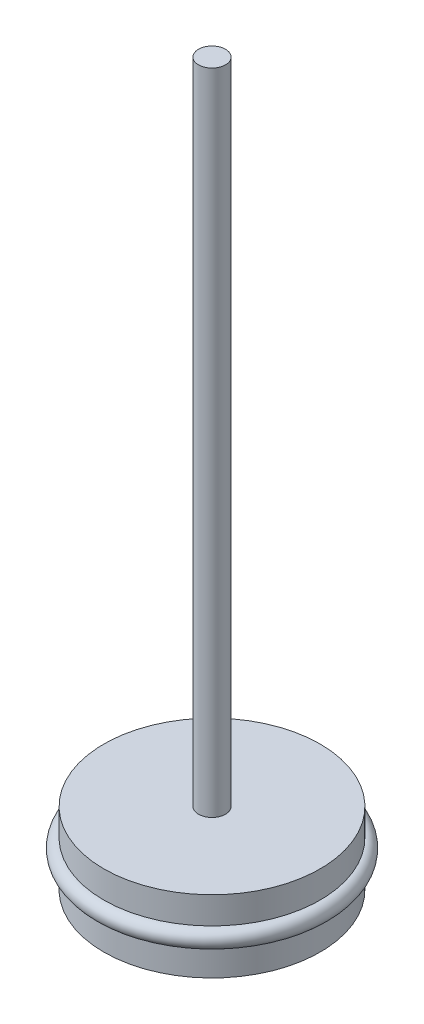
ISO-10303-21;
HEADER;
FILE_DESCRIPTION(('STEP AP214'),'2;1');
FILE_NAME('part.step','',(''),(''),'','','');
FILE_SCHEMA(('AUTOMOTIVE_DESIGN { 1 0 10303 214 1 1 1 1 }'));
ENDSEC;
DATA;
#1=APPLICATION_CONTEXT('core data for automotive mechanical design processes');
#2=APPLICATION_PROTOCOL_DEFINITION('international standard','automotive_design',2000,#1);
#3=PRODUCT_CONTEXT('',#1,'mechanical');
#4=PRODUCT('Part','Part','',(#3));
#5=PRODUCT_RELATED_PRODUCT_CATEGORY('part','',(#4));
#6=PRODUCT_DEFINITION_FORMATION('','',#4);
#7=PRODUCT_DEFINITION_CONTEXT('part definition',#1,'design');
#8=PRODUCT_DEFINITION('design','',#6,#7);
#9=PRODUCT_DEFINITION_SHAPE('','',#8);
#10=(LENGTH_UNIT() NAMED_UNIT(*) SI_UNIT(.MILLI.,.METRE.));
#11=(NAMED_UNIT(*) PLANE_ANGLE_UNIT() SI_UNIT($,.RADIAN.));
#12=(NAMED_UNIT(*) SI_UNIT($,.STERADIAN.) SOLID_ANGLE_UNIT());
#13=UNCERTAINTY_MEASURE_WITH_UNIT(LENGTH_MEASURE(1.E-05),#10,'distance_accuracy_value','');
#14=(GEOMETRIC_REPRESENTATION_CONTEXT(3) GLOBAL_UNCERTAINTY_ASSIGNED_CONTEXT((#13)) GLOBAL_UNIT_ASSIGNED_CONTEXT((#10,
#11,#12)) REPRESENTATION_CONTEXT('',''));
#15=CARTESIAN_POINT('',(0.,0.,0.));
#16=DIRECTION('',(0.,0.,1.));
#17=DIRECTION('',(1.,0.,0.));
#18=AXIS2_PLACEMENT_3D('',#15,#16,#17);
#19=CARTESIAN_POINT('',(0.,4.,0.));
#20=DIRECTION('',(0.,-1.,0.));
#21=DIRECTION('',(0.,0.,-1.));
#22=AXIS2_PLACEMENT_3D('',#19,#20,#21);
#23=TOROIDAL_SURFACE('',#22,12.,1.);
#24=CARTESIAN_POINT('',(0.,4.,-13.));
#25=VERTEX_POINT('',#24);
#26=VERTEX_LOOP('',#25);
#27=FACE_BOUND('',#26,.T.);
#28=ADVANCED_FACE('F51',(#27),#23,.T.);
#29=CLOSED_SHELL('',(#28));
#30=MANIFOLD_SOLID_BREP('B2',#29);
#31=CARTESIAN_POINT('',(0.,80.,0.));
#32=DIRECTION('',(0.,-1.,0.));
#33=DIRECTION('',(0.,0.,-1.));
#34=AXIS2_PLACEMENT_3D('',#31,#32,#33);
#35=CYLINDRICAL_SURFACE('',#34,1.5);
#36=CARTESIAN_POINT('',(0.,3.,0.));
#37=DIRECTION('',(0.,1.,0.));
#38=DIRECTION('',(0.,0.,1.));
#39=AXIS2_PLACEMENT_3D('',#36,#37,#38);
#40=CIRCLE('',#39,1.5);
#41=CARTESIAN_POINT('',(0.,3.,1.5));
#42=VERTEX_POINT('',#41);
#43=EDGE_CURVE('E78',#42,#42,#40,.T.);
#44=ORIENTED_EDGE('',*,*,#43,.T.);
#45=EDGE_LOOP('',(#44));
#46=FACE_BOUND('',#45,.T.);
#47=CARTESIAN_POINT('',(0.,5.,0.));
#48=DIRECTION('',(0.,1.,0.));
#49=DIRECTION('',(0.,0.,1.));
#50=AXIS2_PLACEMENT_3D('',#47,#48,#49);
#51=CIRCLE('',#50,1.5);
#52=CARTESIAN_POINT('',(0.,5.,1.5));
#53=VERTEX_POINT('',#52);
#54=EDGE_CURVE('E50',#53,#53,#51,.T.);
#55=ORIENTED_EDGE('',*,*,#54,.F.);
#56=EDGE_LOOP('',(#55));
#57=FACE_BOUND('',#56,.T.);
#58=ADVANCED_FACE('F62',(#46,#57),#35,.T.);
#59=CARTESIAN_POINT('',(0.,3.,0.));
#60=DIRECTION('',(0.,1.,0.));
#61=DIRECTION('',(0.,0.,1.));
#62=AXIS2_PLACEMENT_3D('',#59,#60,#61);
#63=PLANE('',#62);
#64=CARTESIAN_POINT('',(0.,3.,0.));
#65=DIRECTION('',(0.,1.,0.));
#66=DIRECTION('',(0.,0.,1.));
#67=AXIS2_PLACEMENT_3D('',#64,#65,#66);
#68=CIRCLE('',#67,12.);
#69=CARTESIAN_POINT('',(0.,3.,12.));
#70=VERTEX_POINT('',#69);
#71=EDGE_CURVE('E69',#70,#70,#68,.T.);
#72=ORIENTED_EDGE('',*,*,#71,.T.);
#73=EDGE_LOOP('',(#72));
#74=FACE_BOUND('',#73,.T.);
#75=ORIENTED_EDGE('',*,*,#43,.F.);
#76=EDGE_LOOP('',(#75));
#77=FACE_BOUND('',#76,.T.);
#78=ADVANCED_FACE('F113',(#74,#77),#63,.T.);
#79=CARTESIAN_POINT('',(0.,0.,0.));
#80=DIRECTION('',(0.,1.,0.));
#81=DIRECTION('',(0.,0.,1.));
#82=AXIS2_PLACEMENT_3D('',#79,#80,#81);
#83=PLANE('',#82);
#84=CARTESIAN_POINT('',(0.,0.,0.));
#85=DIRECTION('',(0.,1.,0.));
#86=DIRECTION('',(0.,0.,1.));
#87=AXIS2_PLACEMENT_3D('',#84,#85,#86);
#88=CIRCLE('',#87,12.);
#89=CARTESIAN_POINT('',(0.,0.,12.));
#90=VERTEX_POINT('',#89);
#91=EDGE_CURVE('E73',#90,#90,#88,.T.);
#92=ORIENTED_EDGE('',*,*,#91,.F.);
#93=EDGE_LOOP('',(#92));
#94=FACE_BOUND('',#93,.T.);
#95=ADVANCED_FACE('F110',(#94),#83,.F.);
#96=CARTESIAN_POINT('',(0.,3.,0.));
#97=DIRECTION('',(0.,-1.,0.));
#98=DIRECTION('',(0.,0.,-1.));
#99=AXIS2_PLACEMENT_3D('',#96,#97,#98);
#100=CYLINDRICAL_SURFACE('',#99,12.);
#101=ORIENTED_EDGE('',*,*,#71,.F.);
#102=EDGE_LOOP('',(#101));
#103=FACE_BOUND('',#102,.T.);
#104=ORIENTED_EDGE('',*,*,#91,.T.);
#105=EDGE_LOOP('',(#104));
#106=FACE_BOUND('',#105,.T.);
#107=ADVANCED_FACE('F64',(#103,#106),#100,.T.);
#108=CARTESIAN_POINT('',(0.,8.,0.));
#109=DIRECTION('',(0.,1.,0.));
#110=DIRECTION('',(0.,0.,1.));
#111=AXIS2_PLACEMENT_3D('',#108,#109,#110);
#112=PLANE('',#111);
#113=CARTESIAN_POINT('',(0.,8.,0.));
#114=DIRECTION('',(0.,1.,0.));
#115=DIRECTION('',(0.,0.,1.));
#116=AXIS2_PLACEMENT_3D('',#113,#114,#115);
#117=CIRCLE('',#116,12.);
#118=CARTESIAN_POINT('',(0.,8.,12.));
#119=VERTEX_POINT('',#118);
#120=EDGE_CURVE('E85',#119,#119,#117,.T.);
#121=ORIENTED_EDGE('',*,*,#120,.T.);
#122=EDGE_LOOP('',(#121));
#123=FACE_BOUND('',#122,.T.);
#124=CARTESIAN_POINT('',(0.,8.,0.));
#125=DIRECTION('',(0.,1.,0.));
#126=DIRECTION('',(0.,0.,1.));
#127=AXIS2_PLACEMENT_3D('',#124,#125,#126);
#128=CIRCLE('',#127,1.5);
#129=CARTESIAN_POINT('',(0.,8.,1.5));
#130=VERTEX_POINT('',#129);
#131=EDGE_CURVE('E89',#130,#130,#128,.T.);
#132=ORIENTED_EDGE('',*,*,#131,.F.);
#133=EDGE_LOOP('',(#132));
#134=FACE_BOUND('',#133,.T.);
#135=ADVANCED_FACE('F98',(#123,#134),#112,.T.);
#136=CARTESIAN_POINT('',(0.,5.,0.));
#137=DIRECTION('',(0.,1.,0.));
#138=DIRECTION('',(0.,0.,1.));
#139=AXIS2_PLACEMENT_3D('',#136,#137,#138);
#140=PLANE('',#139);
#141=CARTESIAN_POINT('',(0.,5.,0.));
#142=DIRECTION('',(0.,1.,0.));
#143=DIRECTION('',(0.,0.,1.));
#144=AXIS2_PLACEMENT_3D('',#141,#142,#143);
#145=CIRCLE('',#144,12.);
#146=CARTESIAN_POINT('',(0.,5.,12.));
#147=VERTEX_POINT('',#146);
#148=EDGE_CURVE('E86',#147,#147,#145,.T.);
#149=ORIENTED_EDGE('',*,*,#148,.F.);
#150=EDGE_LOOP('',(#149));
#151=FACE_BOUND('',#150,.T.);
#152=ORIENTED_EDGE('',*,*,#54,.T.);
#153=EDGE_LOOP('',(#152));
#154=FACE_BOUND('',#153,.T.);
#155=ADVANCED_FACE('F100',(#151,#154),#140,.F.);
#156=CARTESIAN_POINT('',(0.,8.,0.));
#157=DIRECTION('',(0.,-1.,0.));
#158=DIRECTION('',(0.,0.,-1.));
#159=AXIS2_PLACEMENT_3D('',#156,#157,#158);
#160=CYLINDRICAL_SURFACE('',#159,12.);
#161=ORIENTED_EDGE('',*,*,#120,.F.);
#162=EDGE_LOOP('',(#161));
#163=FACE_BOUND('',#162,.T.);
#164=ORIENTED_EDGE('',*,*,#148,.T.);
#165=EDGE_LOOP('',(#164));
#166=FACE_BOUND('',#165,.T.);
#167=ADVANCED_FACE('F107',(#163,#166),#160,.T.);
#168=CARTESIAN_POINT('',(0.,80.,0.));
#169=DIRECTION('',(0.,1.,0.));
#170=DIRECTION('',(0.,0.,1.));
#171=AXIS2_PLACEMENT_3D('',#168,#169,#170);
#172=PLANE('',#171);
#173=CARTESIAN_POINT('',(0.,80.,0.));
#174=DIRECTION('',(0.,1.,0.));
#175=DIRECTION('',(0.,0.,1.));
#176=AXIS2_PLACEMENT_3D('',#173,#174,#175);
#177=CIRCLE('',#176,1.5);
#178=CARTESIAN_POINT('',(0.,80.,1.5));
#179=VERTEX_POINT('',#178);
#180=EDGE_CURVE('E82',#179,#179,#177,.T.);
#181=ORIENTED_EDGE('',*,*,#180,.T.);
#182=EDGE_LOOP('',(#181));
#183=FACE_BOUND('',#182,.T.);
#184=ADVANCED_FACE('F123',(#183),#172,.T.);
#185=ORIENTED_EDGE('',*,*,#131,.T.);
#186=EDGE_LOOP('',(#185));
#187=FACE_BOUND('',#186,.T.);
#188=ORIENTED_EDGE('',*,*,#180,.F.);
#189=EDGE_LOOP('',(#188));
#190=FACE_BOUND('',#189,.T.);
#191=ADVANCED_FACE('F95',(#187,#190),#35,.T.);
#192=CLOSED_SHELL('',(#58,#78,#95,#107,#135,#155,#167,#184,#191));
#193=MANIFOLD_SOLID_BREP('B6',#192);
#194=ADVANCED_BREP_SHAPE_REPRESENTATION('',(#18,#30,#193),#14);
#195=SHAPE_DEFINITION_REPRESENTATION(#9,#194);
ENDSEC;
END-ISO-10303-21;
